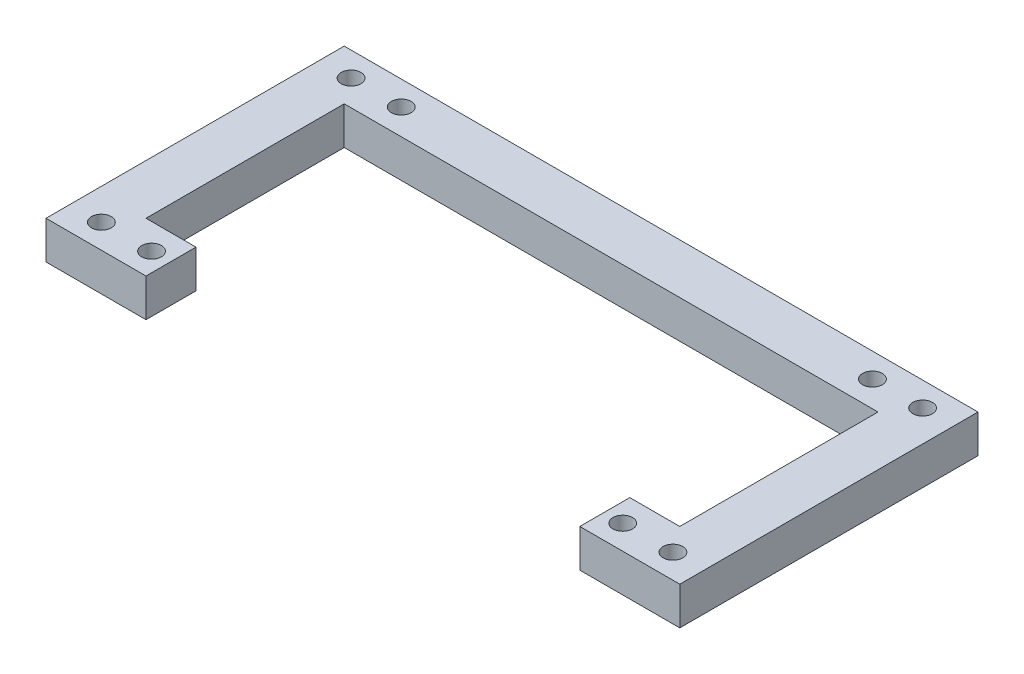
ISO-10303-21;
HEADER;
FILE_DESCRIPTION(('STEP AP214'),'2;1');
FILE_NAME('part.step','',(''),(''),'','','');
FILE_SCHEMA(('AUTOMOTIVE_DESIGN { 1 0 10303 214 1 1 1 1 }'));
ENDSEC;
DATA;
#1=APPLICATION_CONTEXT('core data for automotive mechanical design processes');
#2=APPLICATION_PROTOCOL_DEFINITION('international standard','automotive_design',2000,#1);
#3=PRODUCT_CONTEXT('',#1,'mechanical');
#4=PRODUCT('Part','Part','',(#3));
#5=PRODUCT_RELATED_PRODUCT_CATEGORY('part','',(#4));
#6=PRODUCT_DEFINITION_FORMATION('','',#4);
#7=PRODUCT_DEFINITION_CONTEXT('part definition',#1,'design');
#8=PRODUCT_DEFINITION('design','',#6,#7);
#9=PRODUCT_DEFINITION_SHAPE('','',#8);
#10=(LENGTH_UNIT() NAMED_UNIT(*) SI_UNIT(.MILLI.,.METRE.));
#11=(NAMED_UNIT(*) PLANE_ANGLE_UNIT() SI_UNIT($,.RADIAN.));
#12=(NAMED_UNIT(*) SI_UNIT($,.STERADIAN.) SOLID_ANGLE_UNIT());
#13=UNCERTAINTY_MEASURE_WITH_UNIT(LENGTH_MEASURE(1.E-05),#10,'distance_accuracy_value','');
#14=(GEOMETRIC_REPRESENTATION_CONTEXT(3) GLOBAL_UNCERTAINTY_ASSIGNED_CONTEXT((#13)) GLOBAL_UNIT_ASSIGNED_CONTEXT((#10,
#11,#12)) REPRESENTATION_CONTEXT('',''));
#15=CARTESIAN_POINT('',(0.,0.,0.));
#16=DIRECTION('',(0.,0.,1.));
#17=DIRECTION('',(1.,0.,0.));
#18=AXIS2_PLACEMENT_3D('',#15,#16,#17);
#19=CARTESIAN_POINT('',(0.,6.35,-11.9978965517241));
#20=DIRECTION('',(0.,0.,-1.));
#21=DIRECTION('',(-1.,0.,0.));
#22=AXIS2_PLACEMENT_3D('',#19,#20,#21);
#23=PLANE('',#22);
#24=DIRECTION('',(1.,0.,0.));
#25=VECTOR('',#24,1.);
#26=CARTESIAN_POINT('',(0.,0.,-11.9978965517241));
#27=LINE('',#26,#25);
#28=CARTESIAN_POINT('',(75.155177047282,0.,-11.9978965517241));
#29=VERTEX_POINT('',#28);
#30=CARTESIAN_POINT('',(91.919177047282,0.,-11.9978965517241));
#31=VERTEX_POINT('',#30);
#32=EDGE_CURVE('E184',#29,#31,#27,.T.);
#33=ORIENTED_EDGE('',*,*,#32,.T.);
#34=DIRECTION('',(0.,-1.,0.));
#35=VECTOR('',#34,1.);
#36=CARTESIAN_POINT('',(91.919177047282,6.35,-11.9978965517241));
#37=LINE('',#36,#35);
#38=CARTESIAN_POINT('',(91.919177047282,6.35,-11.9978965517241));
#39=VERTEX_POINT('',#38);
#40=EDGE_CURVE('E11',#39,#31,#37,.T.);
#41=ORIENTED_EDGE('',*,*,#40,.F.);
#42=DIRECTION('',(1.,0.,0.));
#43=VECTOR('',#42,1.);
#44=CARTESIAN_POINT('',(0.,6.35,-11.9978965517241));
#45=LINE('',#44,#43);
#46=CARTESIAN_POINT('',(75.155177047282,6.35,-11.9978965517241));
#47=VERTEX_POINT('',#46);
#48=EDGE_CURVE('E276',#47,#39,#45,.T.);
#49=ORIENTED_EDGE('',*,*,#48,.F.);
#50=DIRECTION('',(0.,-1.,0.));
#51=VECTOR('',#50,1.);
#52=CARTESIAN_POINT('',(75.155177047282,6.35,-11.9978965517241));
#53=LINE('',#52,#51);
#54=EDGE_CURVE('E54',#47,#29,#53,.T.);
#55=ORIENTED_EDGE('',*,*,#54,.T.);
#56=EDGE_LOOP('',(#33,#41,#49,#55));
#57=FACE_BOUND('',#56,.T.);
#58=ADVANCED_FACE('F37',(#57),#23,.F.);
#59=CARTESIAN_POINT('',(91.919177047282,6.35,0.));
#60=DIRECTION('',(-1.,0.,0.));
#61=DIRECTION('',(0.,0.,1.));
#62=AXIS2_PLACEMENT_3D('',#59,#60,#61);
#63=PLANE('',#62);
#64=DIRECTION('',(0.,0.,-1.));
#65=VECTOR('',#64,1.);
#66=CARTESIAN_POINT('',(91.919177047282,0.,0.));
#67=LINE('',#66,#65);
#68=CARTESIAN_POINT('',(91.919177047282,0.,-20.3798965517241));
#69=VERTEX_POINT('',#68);
#70=EDGE_CURVE('E186',#31,#69,#67,.T.);
#71=ORIENTED_EDGE('',*,*,#70,.T.);
#72=DIRECTION('',(0.,-1.,0.));
#73=VECTOR('',#72,1.);
#74=CARTESIAN_POINT('',(91.919177047282,6.35,-20.3798965517241));
#75=LINE('',#74,#73);
#76=CARTESIAN_POINT('',(91.919177047282,6.35,-20.3798965517241));
#77=VERTEX_POINT('',#76);
#78=EDGE_CURVE('E46',#77,#69,#75,.T.);
#79=ORIENTED_EDGE('',*,*,#78,.F.);
#80=DIRECTION('',(0.,0.,-1.));
#81=VECTOR('',#80,1.);
#82=CARTESIAN_POINT('',(91.919177047282,6.35,0.));
#83=LINE('',#82,#81);
#84=EDGE_CURVE('E104',#39,#77,#83,.T.);
#85=ORIENTED_EDGE('',*,*,#84,.F.);
#86=ORIENTED_EDGE('',*,*,#40,.T.);
#87=EDGE_LOOP('',(#71,#79,#85,#86));
#88=FACE_BOUND('',#87,.T.);
#89=ADVANCED_FACE('F258',(#88),#63,.F.);
#90=CARTESIAN_POINT('',(0.,6.35,-20.3798965517241));
#91=DIRECTION('',(0.,0.,-1.));
#92=DIRECTION('',(-1.,0.,0.));
#93=AXIS2_PLACEMENT_3D('',#90,#91,#92);
#94=PLANE('',#93);
#95=DIRECTION('',(1.,0.,0.));
#96=VECTOR('',#95,1.);
#97=CARTESIAN_POINT('',(0.,0.,-20.3798965517241));
#98=LINE('',#97,#96);
#99=CARTESIAN_POINT('',(83.537177047282,0.,-20.3798965517241));
#100=VERTEX_POINT('',#99);
#101=EDGE_CURVE('E189',#100,#69,#98,.T.);
#102=ORIENTED_EDGE('',*,*,#101,.F.);
#103=DIRECTION('',(0.,-1.,0.));
#104=VECTOR('',#103,1.);
#105=CARTESIAN_POINT('',(83.537177047282,6.35,-20.3798965517241));
#106=LINE('',#105,#104);
#107=CARTESIAN_POINT('',(83.537177047282,6.35,-20.3798965517241));
#108=VERTEX_POINT('',#107);
#109=EDGE_CURVE('E251',#108,#100,#106,.T.);
#110=ORIENTED_EDGE('',*,*,#109,.F.);
#111=DIRECTION('',(1.,0.,0.));
#112=VECTOR('',#111,1.);
#113=CARTESIAN_POINT('',(0.,6.35,-20.3798965517241));
#114=LINE('',#113,#112);
#115=EDGE_CURVE('E257',#108,#77,#114,.T.);
#116=ORIENTED_EDGE('',*,*,#115,.T.);
#117=ORIENTED_EDGE('',*,*,#78,.T.);
#118=EDGE_LOOP('',(#102,#110,#116,#117));
#119=FACE_BOUND('',#118,.T.);
#120=ADVANCED_FACE('F255',(#119),#94,.T.);
#121=CARTESIAN_POINT('',(83.537177047282,6.35,0.));
#122=DIRECTION('',(-1.,0.,0.));
#123=DIRECTION('',(0.,0.,1.));
#124=AXIS2_PLACEMENT_3D('',#121,#122,#123);
#125=PLANE('',#124);
#126=DIRECTION('',(0.,0.,-1.));
#127=VECTOR('',#126,1.);
#128=CARTESIAN_POINT('',(83.537177047282,0.,0.));
#129=LINE('',#128,#127);
#130=CARTESIAN_POINT('',(83.537177047282,0.,-53.6158965517241));
#131=VERTEX_POINT('',#130);
#132=EDGE_CURVE('E192',#100,#131,#129,.T.);
#133=ORIENTED_EDGE('',*,*,#132,.T.);
#134=DIRECTION('',(0.,-1.,0.));
#135=VECTOR('',#134,1.);
#136=CARTESIAN_POINT('',(83.537177047282,6.35,-53.6158965517241));
#137=LINE('',#136,#135);
#138=CARTESIAN_POINT('',(83.537177047282,6.35,-53.6158965517241));
#139=VERTEX_POINT('',#138);
#140=EDGE_CURVE('E249',#139,#131,#137,.T.);
#141=ORIENTED_EDGE('',*,*,#140,.F.);
#142=DIRECTION('',(0.,0.,-1.));
#143=VECTOR('',#142,1.);
#144=CARTESIAN_POINT('',(83.537177047282,6.35,0.));
#145=LINE('',#144,#143);
#146=EDGE_CURVE('E271',#108,#139,#145,.T.);
#147=ORIENTED_EDGE('',*,*,#146,.F.);
#148=ORIENTED_EDGE('',*,*,#109,.T.);
#149=EDGE_LOOP('',(#133,#141,#147,#148));
#150=FACE_BOUND('',#149,.T.);
#151=ADVANCED_FACE('F268',(#150),#125,.F.);
#152=CARTESIAN_POINT('',(0.,6.35,-53.6158965517241));
#153=DIRECTION('',(0.,0.,1.));
#154=DIRECTION('',(1.,0.,0.));
#155=AXIS2_PLACEMENT_3D('',#152,#153,#154);
#156=PLANE('',#155);
#157=DIRECTION('',(-1.,0.,0.));
#158=VECTOR('',#157,1.);
#159=CARTESIAN_POINT('',(0.,0.,-53.6158965517241));
#160=LINE('',#159,#158);
#161=CARTESIAN_POINT('',(173.037829353698,0.,-53.6158965517242));
#162=VERTEX_POINT('',#161);
#163=EDGE_CURVE('E195',#162,#131,#160,.T.);
#164=ORIENTED_EDGE('',*,*,#163,.F.);
#165=DIRECTION('',(0.,-1.,0.));
#166=VECTOR('',#165,1.);
#167=CARTESIAN_POINT('',(173.037829353698,6.35,-53.6158965517242));
#168=LINE('',#167,#166);
#169=CARTESIAN_POINT('',(173.037829353698,6.35,-53.6158965517242));
#170=VERTEX_POINT('',#169);
#171=EDGE_CURVE('E247',#170,#162,#168,.T.);
#172=ORIENTED_EDGE('',*,*,#171,.F.);
#173=DIRECTION('',(-1.,0.,0.));
#174=VECTOR('',#173,1.);
#175=CARTESIAN_POINT('',(0.,6.35,-53.6158965517241));
#176=LINE('',#175,#174);
#177=EDGE_CURVE('E273',#170,#139,#176,.T.);
#178=ORIENTED_EDGE('',*,*,#177,.T.);
#179=ORIENTED_EDGE('',*,*,#140,.T.);
#180=EDGE_LOOP('',(#164,#172,#178,#179));
#181=FACE_BOUND('',#180,.T.);
#182=ADVANCED_FACE('F315',(#181),#156,.T.);
#183=CARTESIAN_POINT('',(173.037829353698,6.35,0.));
#184=DIRECTION('',(1.,0.,0.));
#185=DIRECTION('',(0.,0.,-1.));
#186=AXIS2_PLACEMENT_3D('',#183,#184,#185);
#187=PLANE('',#186);
#188=DIRECTION('',(0.,0.,1.));
#189=VECTOR('',#188,1.);
#190=CARTESIAN_POINT('',(173.037829353698,0.,0.));
#191=LINE('',#190,#189);
#192=CARTESIAN_POINT('',(173.037829353698,0.,-20.3798965517242));
#193=VERTEX_POINT('',#192);
#194=EDGE_CURVE('E198',#162,#193,#191,.T.);
#195=ORIENTED_EDGE('',*,*,#194,.T.);
#196=DIRECTION('',(0.,-1.,0.));
#197=VECTOR('',#196,1.);
#198=CARTESIAN_POINT('',(173.037829353698,6.35,-20.3798965517242));
#199=LINE('',#198,#197);
#200=CARTESIAN_POINT('',(173.037829353698,6.35,-20.3798965517242));
#201=VERTEX_POINT('',#200);
#202=EDGE_CURVE('E244',#201,#193,#199,.T.);
#203=ORIENTED_EDGE('',*,*,#202,.F.);
#204=DIRECTION('',(0.,0.,1.));
#205=VECTOR('',#204,1.);
#206=CARTESIAN_POINT('',(173.037829353698,6.35,0.));
#207=LINE('',#206,#205);
#208=EDGE_CURVE('E281',#170,#201,#207,.T.);
#209=ORIENTED_EDGE('',*,*,#208,.F.);
#210=ORIENTED_EDGE('',*,*,#171,.T.);
#211=EDGE_LOOP('',(#195,#203,#209,#210));
#212=FACE_BOUND('',#211,.T.);
#213=ADVANCED_FACE('F318',(#212),#187,.F.);
#214=CARTESIAN_POINT('',(0.,6.35,-20.3798965517242));
#215=DIRECTION('',(0.,0.,1.));
#216=DIRECTION('',(1.,0.,0.));
#217=AXIS2_PLACEMENT_3D('',#214,#215,#216);
#218=PLANE('',#217);
#219=DIRECTION('',(-1.,0.,0.));
#220=VECTOR('',#219,1.);
#221=CARTESIAN_POINT('',(0.,0.,-20.3798965517242));
#222=LINE('',#221,#220);
#223=CARTESIAN_POINT('',(164.655829353698,0.,-20.3798965517242));
#224=VERTEX_POINT('',#223);
#225=EDGE_CURVE('E200',#193,#224,#222,.T.);
#226=ORIENTED_EDGE('',*,*,#225,.T.);
#227=DIRECTION('',(0.,-1.,0.));
#228=VECTOR('',#227,1.);
#229=CARTESIAN_POINT('',(164.655829353698,6.35,-20.3798965517242));
#230=LINE('',#229,#228);
#231=CARTESIAN_POINT('',(164.655829353698,6.35,-20.3798965517242));
#232=VERTEX_POINT('',#231);
#233=EDGE_CURVE('E242',#232,#224,#230,.T.);
#234=ORIENTED_EDGE('',*,*,#233,.F.);
#235=DIRECTION('',(-1.,0.,0.));
#236=VECTOR('',#235,1.);
#237=CARTESIAN_POINT('',(0.,6.35,-20.3798965517242));
#238=LINE('',#237,#236);
#239=EDGE_CURVE('E283',#201,#232,#238,.T.);
#240=ORIENTED_EDGE('',*,*,#239,.F.);
#241=ORIENTED_EDGE('',*,*,#202,.T.);
#242=EDGE_LOOP('',(#226,#234,#240,#241));
#243=FACE_BOUND('',#242,.T.);
#244=ADVANCED_FACE('F322',(#243),#218,.F.);
#245=CARTESIAN_POINT('',(164.655829353698,6.35,5.45229935836391E-13));
#246=DIRECTION('',(-1.,0.,0.));
#247=DIRECTION('',(0.,0.,1.));
#248=AXIS2_PLACEMENT_3D('',#245,#246,#247);
#249=PLANE('',#248);
#250=DIRECTION('',(0.,0.,-1.));
#251=VECTOR('',#250,1.);
#252=CARTESIAN_POINT('',(164.655829353698,0.,5.45229935836391E-13));
#253=LINE('',#252,#251);
#254=CARTESIAN_POINT('',(164.655829353698,0.,-11.9978965517242));
#255=VERTEX_POINT('',#254);
#256=EDGE_CURVE('E203',#255,#224,#253,.T.);
#257=ORIENTED_EDGE('',*,*,#256,.F.);
#258=DIRECTION('',(0.,-1.,0.));
#259=VECTOR('',#258,1.);
#260=CARTESIAN_POINT('',(164.655829353698,6.35,-11.9978965517242));
#261=LINE('',#260,#259);
#262=CARTESIAN_POINT('',(164.655829353698,6.35,-11.9978965517242));
#263=VERTEX_POINT('',#262);
#264=EDGE_CURVE('E240',#263,#255,#261,.T.);
#265=ORIENTED_EDGE('',*,*,#264,.F.);
#266=DIRECTION('',(0.,0.,-1.));
#267=VECTOR('',#266,1.);
#268=CARTESIAN_POINT('',(164.655829353698,6.35,5.45229935836391E-13));
#269=LINE('',#268,#267);
#270=EDGE_CURVE('E285',#263,#232,#269,.T.);
#271=ORIENTED_EDGE('',*,*,#270,.T.);
#272=ORIENTED_EDGE('',*,*,#233,.T.);
#273=EDGE_LOOP('',(#257,#265,#271,#272));
#274=FACE_BOUND('',#273,.T.);
#275=ADVANCED_FACE('F326',(#274),#249,.T.);
#276=CARTESIAN_POINT('',(0.,6.35,-11.9978965517242));
#277=DIRECTION('',(0.,0.,1.));
#278=DIRECTION('',(1.,0.,0.));
#279=AXIS2_PLACEMENT_3D('',#276,#277,#278);
#280=PLANE('',#279);
#281=DIRECTION('',(-1.,0.,0.));
#282=VECTOR('',#281,1.);
#283=CARTESIAN_POINT('',(0.,0.,-11.9978965517242));
#284=LINE('',#283,#282);
#285=CARTESIAN_POINT('',(181.419829353698,0.,-11.9978965517242));
#286=VERTEX_POINT('',#285);
#287=EDGE_CURVE('E206',#286,#255,#284,.T.);
#288=ORIENTED_EDGE('',*,*,#287,.F.);
#289=DIRECTION('',(0.,-1.,0.));
#290=VECTOR('',#289,1.);
#291=CARTESIAN_POINT('',(181.419829353698,6.35,-11.9978965517242));
#292=LINE('',#291,#290);
#293=CARTESIAN_POINT('',(181.419829353698,6.35,-11.9978965517242));
#294=VERTEX_POINT('',#293);
#295=EDGE_CURVE('E141',#294,#286,#292,.T.);
#296=ORIENTED_EDGE('',*,*,#295,.F.);
#297=DIRECTION('',(-1.,0.,0.));
#298=VECTOR('',#297,1.);
#299=CARTESIAN_POINT('',(0.,6.35,-11.9978965517242));
#300=LINE('',#299,#298);
#301=EDGE_CURVE('E152',#294,#263,#300,.T.);
#302=ORIENTED_EDGE('',*,*,#301,.T.);
#303=ORIENTED_EDGE('',*,*,#264,.T.);
#304=EDGE_LOOP('',(#288,#296,#302,#303));
#305=FACE_BOUND('',#304,.T.);
#306=ADVANCED_FACE('F289',(#305),#280,.T.);
#307=CARTESIAN_POINT('',(181.419829353698,6.35,-3.02124707508063E-13));
#308=DIRECTION('',(1.,0.,0.));
#309=DIRECTION('',(0.,0.,-1.));
#310=AXIS2_PLACEMENT_3D('',#307,#308,#309);
#311=PLANE('',#310);
#312=DIRECTION('',(0.,0.,1.));
#313=VECTOR('',#312,1.);
#314=CARTESIAN_POINT('',(181.419829353698,0.,-3.02124707508063E-13));
#315=LINE('',#314,#313);
#316=CARTESIAN_POINT('',(181.419829353698,0.,-61.9978965517242));
#317=VERTEX_POINT('',#316);
#318=EDGE_CURVE('E137',#317,#286,#315,.T.);
#319=ORIENTED_EDGE('',*,*,#318,.F.);
#320=DIRECTION('',(0.,-1.,0.));
#321=VECTOR('',#320,1.);
#322=CARTESIAN_POINT('',(181.419829353698,6.35,-61.9978965517242));
#323=LINE('',#322,#321);
#324=CARTESIAN_POINT('',(181.419829353698,6.35,-61.9978965517242));
#325=VERTEX_POINT('',#324);
#326=EDGE_CURVE('E132',#325,#317,#323,.T.);
#327=ORIENTED_EDGE('',*,*,#326,.F.);
#328=DIRECTION('',(0.,0.,1.));
#329=VECTOR('',#328,1.);
#330=CARTESIAN_POINT('',(181.419829353698,6.35,-3.02124707508063E-13));
#331=LINE('',#330,#329);
#332=EDGE_CURVE('E135',#325,#294,#331,.T.);
#333=ORIENTED_EDGE('',*,*,#332,.T.);
#334=ORIENTED_EDGE('',*,*,#295,.T.);
#335=EDGE_LOOP('',(#319,#327,#333,#334));
#336=FACE_BOUND('',#335,.T.);
#337=ADVANCED_FACE('F134',(#336),#311,.T.);
#338=CARTESIAN_POINT('',(0.,6.35,-61.9978965517241));
#339=DIRECTION('',(0.,0.,-1.));
#340=DIRECTION('',(-1.,0.,0.));
#341=AXIS2_PLACEMENT_3D('',#338,#339,#340);
#342=PLANE('',#341);
#343=DIRECTION('',(1.,0.,0.));
#344=VECTOR('',#343,1.);
#345=CARTESIAN_POINT('',(0.,0.,-61.9978965517241));
#346=LINE('',#345,#344);
#347=CARTESIAN_POINT('',(75.155177047282,0.,-61.9978965517241));
#348=VERTEX_POINT('',#347);
#349=EDGE_CURVE('E210',#348,#317,#346,.T.);
#350=ORIENTED_EDGE('',*,*,#349,.F.);
#351=DIRECTION('',(0.,-1.,0.));
#352=VECTOR('',#351,1.);
#353=CARTESIAN_POINT('',(75.155177047282,6.35,-61.9978965517241));
#354=LINE('',#353,#352);
#355=CARTESIAN_POINT('',(75.155177047282,6.35,-61.9978965517241));
#356=VERTEX_POINT('',#355);
#357=EDGE_CURVE('E92',#356,#348,#354,.T.);
#358=ORIENTED_EDGE('',*,*,#357,.F.);
#359=DIRECTION('',(1.,0.,0.));
#360=VECTOR('',#359,1.);
#361=CARTESIAN_POINT('',(0.,6.35,-61.9978965517241));
#362=LINE('',#361,#360);
#363=EDGE_CURVE('E149',#356,#325,#362,.T.);
#364=ORIENTED_EDGE('',*,*,#363,.T.);
#365=ORIENTED_EDGE('',*,*,#326,.T.);
#366=EDGE_LOOP('',(#350,#358,#364,#365));
#367=FACE_BOUND('',#366,.T.);
#368=ADVANCED_FACE('F154',(#367),#342,.T.);
#369=CARTESIAN_POINT('',(176.20282520049,6.35,-57.9310082298693));
#370=DIRECTION('',(0.,-1.,0.));
#371=DIRECTION('',(0.,0.,-1.));
#372=AXIS2_PLACEMENT_3D('',#369,#370,#371);
#373=CYLINDRICAL_SURFACE('',#372,1.65100000000002);
#374=CARTESIAN_POINT('',(176.20282520049,6.35,-57.9310082298693));
#375=DIRECTION('',(0.,1.,0.));
#376=DIRECTION('',(0.,0.,1.));
#377=AXIS2_PLACEMENT_3D('',#374,#375,#376);
#378=CIRCLE('',#377,1.65100000000002);
#379=CARTESIAN_POINT('',(176.20282520049,6.35,-56.2800082298693));
#380=VERTEX_POINT('',#379);
#381=EDGE_CURVE('E175',#380,#380,#378,.F.);
#382=ORIENTED_EDGE('',*,*,#381,.F.);
#383=EDGE_LOOP('',(#382));
#384=FACE_BOUND('',#383,.T.);
#385=CARTESIAN_POINT('',(176.20282520049,0.,-57.9310082298693));
#386=DIRECTION('',(0.,1.,0.));
#387=DIRECTION('',(0.,0.,1.));
#388=AXIS2_PLACEMENT_3D('',#385,#386,#387);
#389=CIRCLE('',#388,1.65100000000002);
#390=CARTESIAN_POINT('',(176.20282520049,0.,-56.2800082298693));
#391=VERTEX_POINT('',#390);
#392=EDGE_CURVE('E230',#391,#391,#389,.F.);
#393=ORIENTED_EDGE('',*,*,#392,.T.);
#394=EDGE_LOOP('',(#393));
#395=FACE_BOUND('',#394,.T.);
#396=ADVANCED_FACE('F335',(#384,#395),#373,.F.);
#397=CARTESIAN_POINT('',(176.20282520049,6.35,-16.0647848735792));
#398=DIRECTION('',(0.,-1.,0.));
#399=DIRECTION('',(0.,0.,-1.));
#400=AXIS2_PLACEMENT_3D('',#397,#398,#399);
#401=CYLINDRICAL_SURFACE('',#400,1.65100000000002);
#402=CARTESIAN_POINT('',(176.20282520049,6.35,-16.0647848735792));
#403=DIRECTION('',(0.,1.,0.));
#404=DIRECTION('',(0.,0.,1.));
#405=AXIS2_PLACEMENT_3D('',#402,#403,#404);
#406=CIRCLE('',#405,1.65100000000002);
#407=CARTESIAN_POINT('',(176.20282520049,6.35,-14.4137848735791));
#408=VERTEX_POINT('',#407);
#409=EDGE_CURVE('E172',#408,#408,#406,.T.);
#410=ORIENTED_EDGE('',*,*,#409,.T.);
#411=EDGE_LOOP('',(#410));
#412=FACE_BOUND('',#411,.T.);
#413=CARTESIAN_POINT('',(176.20282520049,0.,-16.0647848735792));
#414=DIRECTION('',(0.,1.,0.));
#415=DIRECTION('',(0.,0.,1.));
#416=AXIS2_PLACEMENT_3D('',#413,#414,#415);
#417=CIRCLE('',#416,1.65100000000002);
#418=CARTESIAN_POINT('',(176.20282520049,0.,-14.4137848735791));
#419=VERTEX_POINT('',#418);
#420=EDGE_CURVE('E227',#419,#419,#417,.T.);
#421=ORIENTED_EDGE('',*,*,#420,.F.);
#422=EDGE_LOOP('',(#421));
#423=FACE_BOUND('',#422,.T.);
#424=ADVANCED_FACE('F339',(#412,#423),#401,.F.);
#425=CARTESIAN_POINT('',(88.7874552004898,6.35,-16.0647848735786));
#426=DIRECTION('',(0.,-1.,0.));
#427=DIRECTION('',(0.,0.,-1.));
#428=AXIS2_PLACEMENT_3D('',#425,#426,#427);
#429=CYLINDRICAL_SURFACE('',#428,1.65100000000001);
#430=CARTESIAN_POINT('',(88.7874552004898,6.35,-16.0647848735786));
#431=DIRECTION('',(0.,1.,0.));
#432=DIRECTION('',(0.,0.,1.));
#433=AXIS2_PLACEMENT_3D('',#430,#431,#432);
#434=CIRCLE('',#433,1.65100000000001);
#435=CARTESIAN_POINT('',(88.7874552004898,6.35,-14.4137848735786));
#436=VERTEX_POINT('',#435);
#437=EDGE_CURVE('E169',#436,#436,#434,.T.);
#438=ORIENTED_EDGE('',*,*,#437,.T.);
#439=EDGE_LOOP('',(#438));
#440=FACE_BOUND('',#439,.T.);
#441=CARTESIAN_POINT('',(88.7874552004898,0.,-16.0647848735786));
#442=DIRECTION('',(0.,1.,0.));
#443=DIRECTION('',(0.,0.,1.));
#444=AXIS2_PLACEMENT_3D('',#441,#442,#443);
#445=CIRCLE('',#444,1.65100000000001);
#446=CARTESIAN_POINT('',(88.7874552004898,0.,-14.4137848735786));
#447=VERTEX_POINT('',#446);
#448=EDGE_CURVE('E224',#447,#447,#445,.T.);
#449=ORIENTED_EDGE('',*,*,#448,.F.);
#450=EDGE_LOOP('',(#449));
#451=FACE_BOUND('',#450,.T.);
#452=ADVANCED_FACE('F345',(#440,#451),#429,.F.);
#453=CARTESIAN_POINT('',(88.7874552004898,6.35,-57.9310082298697));
#454=DIRECTION('',(0.,-1.,0.));
#455=DIRECTION('',(0.,0.,-1.));
#456=AXIS2_PLACEMENT_3D('',#453,#454,#455);
#457=CYLINDRICAL_SURFACE('',#456,1.65100000000001);
#458=CARTESIAN_POINT('',(88.7874552004898,6.35,-57.9310082298697));
#459=DIRECTION('',(0.,1.,0.));
#460=DIRECTION('',(0.,0.,1.));
#461=AXIS2_PLACEMENT_3D('',#458,#459,#460);
#462=CIRCLE('',#461,1.65100000000001);
#463=CARTESIAN_POINT('',(88.7874552004898,6.35,-56.2800082298697));
#464=VERTEX_POINT('',#463);
#465=EDGE_CURVE('E166',#464,#464,#462,.F.);
#466=ORIENTED_EDGE('',*,*,#465,.F.);
#467=EDGE_LOOP('',(#466));
#468=FACE_BOUND('',#467,.T.);
#469=CARTESIAN_POINT('',(88.7874552004898,0.,-57.9310082298697));
#470=DIRECTION('',(0.,1.,0.));
#471=DIRECTION('',(0.,0.,1.));
#472=AXIS2_PLACEMENT_3D('',#469,#470,#471);
#473=CIRCLE('',#472,1.65100000000001);
#474=CARTESIAN_POINT('',(88.7874552004898,0.,-56.2800082298697));
#475=VERTEX_POINT('',#474);
#476=EDGE_CURVE('E221',#475,#475,#473,.F.);
#477=ORIENTED_EDGE('',*,*,#476,.T.);
#478=EDGE_LOOP('',(#477));
#479=FACE_BOUND('',#478,.T.);
#480=ADVANCED_FACE('F355',(#468,#479),#457,.F.);
#481=CARTESIAN_POINT('',(167.78755120049,6.35,-57.9310082298691));
#482=DIRECTION('',(0.,-1.,0.));
#483=DIRECTION('',(0.,0.,-1.));
#484=AXIS2_PLACEMENT_3D('',#481,#482,#483);
#485=CYLINDRICAL_SURFACE('',#484,1.65100000000002);
#486=CARTESIAN_POINT('',(167.78755120049,6.35,-57.9310082298691));
#487=DIRECTION('',(0.,1.,0.));
#488=DIRECTION('',(0.,0.,1.));
#489=AXIS2_PLACEMENT_3D('',#486,#487,#488);
#490=CIRCLE('',#489,1.65100000000002);
#491=CARTESIAN_POINT('',(167.78755120049,6.35,-56.2800082298691));
#492=VERTEX_POINT('',#491);
#493=EDGE_CURVE('E163',#492,#492,#490,.T.);
#494=ORIENTED_EDGE('',*,*,#493,.T.);
#495=EDGE_LOOP('',(#494));
#496=FACE_BOUND('',#495,.T.);
#497=CARTESIAN_POINT('',(167.78755120049,0.,-57.9310082298691));
#498=DIRECTION('',(0.,1.,0.));
#499=DIRECTION('',(0.,0.,1.));
#500=AXIS2_PLACEMENT_3D('',#497,#498,#499);
#501=CIRCLE('',#500,1.65100000000002);
#502=CARTESIAN_POINT('',(167.78755120049,0.,-56.2800082298691));
#503=VERTEX_POINT('',#502);
#504=EDGE_CURVE('E218',#503,#503,#501,.T.);
#505=ORIENTED_EDGE('',*,*,#504,.F.);
#506=EDGE_LOOP('',(#505));
#507=FACE_BOUND('',#506,.T.);
#508=ADVANCED_FACE('F301',(#496,#507),#485,.F.);
#509=CARTESIAN_POINT('',(80.3721812004898,6.35,-16.0647848735792));
#510=DIRECTION('',(0.,-1.,0.));
#511=DIRECTION('',(0.,0.,-1.));
#512=AXIS2_PLACEMENT_3D('',#509,#510,#511);
#513=CYLINDRICAL_SURFACE('',#512,1.65100000000001);
#514=CARTESIAN_POINT('',(80.3721812004898,6.35,-16.0647848735792));
#515=DIRECTION('',(0.,1.,0.));
#516=DIRECTION('',(0.,0.,1.));
#517=AXIS2_PLACEMENT_3D('',#514,#515,#516);
#518=CIRCLE('',#517,1.65100000000001);
#519=CARTESIAN_POINT('',(80.3721812004898,6.35,-14.4137848735792));
#520=VERTEX_POINT('',#519);
#521=EDGE_CURVE('E157',#520,#520,#518,.F.);
#522=ORIENTED_EDGE('',*,*,#521,.F.);
#523=EDGE_LOOP('',(#522));
#524=FACE_BOUND('',#523,.T.);
#525=CARTESIAN_POINT('',(80.3721812004898,0.,-16.0647848735792));
#526=DIRECTION('',(0.,1.,0.));
#527=DIRECTION('',(0.,0.,1.));
#528=AXIS2_PLACEMENT_3D('',#525,#526,#527);
#529=CIRCLE('',#528,1.65100000000001);
#530=CARTESIAN_POINT('',(80.3721812004898,0.,-14.4137848735792));
#531=VERTEX_POINT('',#530);
#532=EDGE_CURVE('E215',#531,#531,#529,.F.);
#533=ORIENTED_EDGE('',*,*,#532,.T.);
#534=EDGE_LOOP('',(#533));
#535=FACE_BOUND('',#534,.T.);
#536=ADVANCED_FACE('F293',(#524,#535),#513,.F.);
#537=CARTESIAN_POINT('',(75.155177047282,6.35,0.));
#538=DIRECTION('',(-1.,0.,0.));
#539=DIRECTION('',(0.,0.,1.));
#540=AXIS2_PLACEMENT_3D('',#537,#538,#539);
#541=PLANE('',#540);
#542=DIRECTION('',(0.,0.,-1.));
#543=VECTOR('',#542,1.);
#544=CARTESIAN_POINT('',(75.155177047282,0.,0.));
#545=LINE('',#544,#543);
#546=EDGE_CURVE('E212',#29,#348,#545,.T.);
#547=ORIENTED_EDGE('',*,*,#546,.F.);
#548=ORIENTED_EDGE('',*,*,#54,.F.);
#549=DIRECTION('',(0.,0.,-1.));
#550=VECTOR('',#549,1.);
#551=CARTESIAN_POINT('',(75.155177047282,6.35,0.));
#552=LINE('',#551,#550);
#553=EDGE_CURVE('E155',#47,#356,#552,.T.);
#554=ORIENTED_EDGE('',*,*,#553,.T.);
#555=ORIENTED_EDGE('',*,*,#357,.T.);
#556=EDGE_LOOP('',(#547,#548,#554,#555));
#557=FACE_BOUND('',#556,.T.);
#558=ADVANCED_FACE('F291',(#557),#541,.T.);
#559=CARTESIAN_POINT('',(80.3721812004898,6.35,-57.9310082298691));
#560=DIRECTION('',(0.,-1.,0.));
#561=DIRECTION('',(0.,0.,-1.));
#562=AXIS2_PLACEMENT_3D('',#559,#560,#561);
#563=CYLINDRICAL_SURFACE('',#562,1.65100000000001);
#564=CARTESIAN_POINT('',(80.3721812004898,6.35,-57.9310082298691));
#565=DIRECTION('',(0.,1.,0.));
#566=DIRECTION('',(0.,0.,1.));
#567=AXIS2_PLACEMENT_3D('',#564,#565,#566);
#568=CIRCLE('',#567,1.65100000000001);
#569=CARTESIAN_POINT('',(80.3721812004898,6.35,-56.2800082298691));
#570=VERTEX_POINT('',#569);
#571=EDGE_CURVE('E236',#570,#570,#568,.T.);
#572=ORIENTED_EDGE('',*,*,#571,.T.);
#573=EDGE_LOOP('',(#572));
#574=FACE_BOUND('',#573,.T.);
#575=CARTESIAN_POINT('',(80.3721812004898,0.,-57.9310082298691));
#576=DIRECTION('',(0.,1.,0.));
#577=DIRECTION('',(0.,0.,1.));
#578=AXIS2_PLACEMENT_3D('',#575,#576,#577);
#579=CIRCLE('',#578,1.65100000000001);
#580=CARTESIAN_POINT('',(80.3721812004898,0.,-56.2800082298691));
#581=VERTEX_POINT('',#580);
#582=EDGE_CURVE('E181',#581,#581,#579,.T.);
#583=ORIENTED_EDGE('',*,*,#582,.F.);
#584=EDGE_LOOP('',(#583));
#585=FACE_BOUND('',#584,.T.);
#586=ADVANCED_FACE('F39',(#574,#585),#563,.F.);
#587=CARTESIAN_POINT('',(167.78755120049,6.35,-16.0647848735792));
#588=DIRECTION('',(0.,-1.,0.));
#589=DIRECTION('',(0.,0.,-1.));
#590=AXIS2_PLACEMENT_3D('',#587,#588,#589);
#591=CYLINDRICAL_SURFACE('',#590,1.65100000000002);
#592=CARTESIAN_POINT('',(167.78755120049,6.35,-16.0647848735792));
#593=DIRECTION('',(0.,1.,0.));
#594=DIRECTION('',(0.,0.,1.));
#595=AXIS2_PLACEMENT_3D('',#592,#593,#594);
#596=CIRCLE('',#595,1.65100000000002);
#597=CARTESIAN_POINT('',(167.78755120049,6.35,-14.4137848735791));
#598=VERTEX_POINT('',#597);
#599=EDGE_CURVE('E178',#598,#598,#596,.F.);
#600=ORIENTED_EDGE('',*,*,#599,.F.);
#601=EDGE_LOOP('',(#600));
#602=FACE_BOUND('',#601,.T.);
#603=CARTESIAN_POINT('',(167.78755120049,0.,-16.0647848735792));
#604=DIRECTION('',(0.,1.,0.));
#605=DIRECTION('',(0.,0.,1.));
#606=AXIS2_PLACEMENT_3D('',#603,#604,#605);
#607=CIRCLE('',#606,1.65100000000002);
#608=CARTESIAN_POINT('',(167.78755120049,0.,-14.4137848735791));
#609=VERTEX_POINT('',#608);
#610=EDGE_CURVE('E233',#609,#609,#607,.F.);
#611=ORIENTED_EDGE('',*,*,#610,.T.);
#612=EDGE_LOOP('',(#611));
#613=FACE_BOUND('',#612,.T.);
#614=ADVANCED_FACE('F299',(#602,#613),#591,.F.);
#615=CARTESIAN_POINT('',(0.,6.35,0.));
#616=DIRECTION('',(0.,1.,0.));
#617=DIRECTION('',(0.,0.,1.));
#618=AXIS2_PLACEMENT_3D('',#615,#616,#617);
#619=PLANE('',#618);
#620=ORIENTED_EDGE('',*,*,#571,.F.);
#621=EDGE_LOOP('',(#620));
#622=FACE_BOUND('',#621,.T.);
#623=ORIENTED_EDGE('',*,*,#48,.T.);
#624=ORIENTED_EDGE('',*,*,#84,.T.);
#625=ORIENTED_EDGE('',*,*,#115,.F.);
#626=ORIENTED_EDGE('',*,*,#146,.T.);
#627=ORIENTED_EDGE('',*,*,#177,.F.);
#628=ORIENTED_EDGE('',*,*,#208,.T.);
#629=ORIENTED_EDGE('',*,*,#239,.T.);
#630=ORIENTED_EDGE('',*,*,#270,.F.);
#631=ORIENTED_EDGE('',*,*,#301,.F.);
#632=ORIENTED_EDGE('',*,*,#332,.F.);
#633=ORIENTED_EDGE('',*,*,#363,.F.);
#634=ORIENTED_EDGE('',*,*,#553,.F.);
#635=EDGE_LOOP('',(#623,#624,#625,#626,#627,#628,#629,#630,#631,#632,#633,#634));
#636=FACE_BOUND('',#635,.T.);
#637=ORIENTED_EDGE('',*,*,#521,.T.);
#638=EDGE_LOOP('',(#637));
#639=FACE_BOUND('',#638,.T.);
#640=ORIENTED_EDGE('',*,*,#493,.F.);
#641=EDGE_LOOP('',(#640));
#642=FACE_BOUND('',#641,.T.);
#643=ORIENTED_EDGE('',*,*,#465,.T.);
#644=EDGE_LOOP('',(#643));
#645=FACE_BOUND('',#644,.T.);
#646=ORIENTED_EDGE('',*,*,#437,.F.);
#647=EDGE_LOOP('',(#646));
#648=FACE_BOUND('',#647,.T.);
#649=ORIENTED_EDGE('',*,*,#409,.F.);
#650=EDGE_LOOP('',(#649));
#651=FACE_BOUND('',#650,.T.);
#652=ORIENTED_EDGE('',*,*,#381,.T.);
#653=EDGE_LOOP('',(#652));
#654=FACE_BOUND('',#653,.T.);
#655=ORIENTED_EDGE('',*,*,#599,.T.);
#656=EDGE_LOOP('',(#655));
#657=FACE_BOUND('',#656,.T.);
#658=ADVANCED_FACE('F146',(#622,#636,#639,#642,#645,#648,#651,#654,#657),#619,.T.);
#659=CARTESIAN_POINT('',(0.,0.,0.));
#660=DIRECTION('',(0.,1.,0.));
#661=DIRECTION('',(0.,0.,1.));
#662=AXIS2_PLACEMENT_3D('',#659,#660,#661);
#663=PLANE('',#662);
#664=ORIENTED_EDGE('',*,*,#582,.T.);
#665=EDGE_LOOP('',(#664));
#666=FACE_BOUND('',#665,.T.);
#667=ORIENTED_EDGE('',*,*,#32,.F.);
#668=ORIENTED_EDGE('',*,*,#546,.T.);
#669=ORIENTED_EDGE('',*,*,#349,.T.);
#670=ORIENTED_EDGE('',*,*,#318,.T.);
#671=ORIENTED_EDGE('',*,*,#287,.T.);
#672=ORIENTED_EDGE('',*,*,#256,.T.);
#673=ORIENTED_EDGE('',*,*,#225,.F.);
#674=ORIENTED_EDGE('',*,*,#194,.F.);
#675=ORIENTED_EDGE('',*,*,#163,.T.);
#676=ORIENTED_EDGE('',*,*,#132,.F.);
#677=ORIENTED_EDGE('',*,*,#101,.T.);
#678=ORIENTED_EDGE('',*,*,#70,.F.);
#679=EDGE_LOOP('',(#667,#668,#669,#670,#671,#672,#673,#674,#675,#676,#677,#678));
#680=FACE_BOUND('',#679,.T.);
#681=ORIENTED_EDGE('',*,*,#532,.F.);
#682=EDGE_LOOP('',(#681));
#683=FACE_BOUND('',#682,.T.);
#684=ORIENTED_EDGE('',*,*,#504,.T.);
#685=EDGE_LOOP('',(#684));
#686=FACE_BOUND('',#685,.T.);
#687=ORIENTED_EDGE('',*,*,#476,.F.);
#688=EDGE_LOOP('',(#687));
#689=FACE_BOUND('',#688,.T.);
#690=ORIENTED_EDGE('',*,*,#448,.T.);
#691=EDGE_LOOP('',(#690));
#692=FACE_BOUND('',#691,.T.);
#693=ORIENTED_EDGE('',*,*,#420,.T.);
#694=EDGE_LOOP('',(#693));
#695=FACE_BOUND('',#694,.T.);
#696=ORIENTED_EDGE('',*,*,#392,.F.);
#697=EDGE_LOOP('',(#696));
#698=FACE_BOUND('',#697,.T.);
#699=ORIENTED_EDGE('',*,*,#610,.F.);
#700=EDGE_LOOP('',(#699));
#701=FACE_BOUND('',#700,.T.);
#702=ADVANCED_FACE('F262',(#666,#680,#683,#686,#689,#692,#695,#698,#701),#663,.F.);
#703=CLOSED_SHELL('',(#58,#89,#120,#151,#182,#213,#244,#275,#306,#337,#368,#396,#424,#452,#480,
#508,#536,#558,#586,#614,#658,#702));
#704=MANIFOLD_SOLID_BREP('B2',#703);
#705=ADVANCED_BREP_SHAPE_REPRESENTATION('',(#18,#704),#14);
#706=SHAPE_DEFINITION_REPRESENTATION(#9,#705);
ENDSEC;
END-ISO-10303-21;
